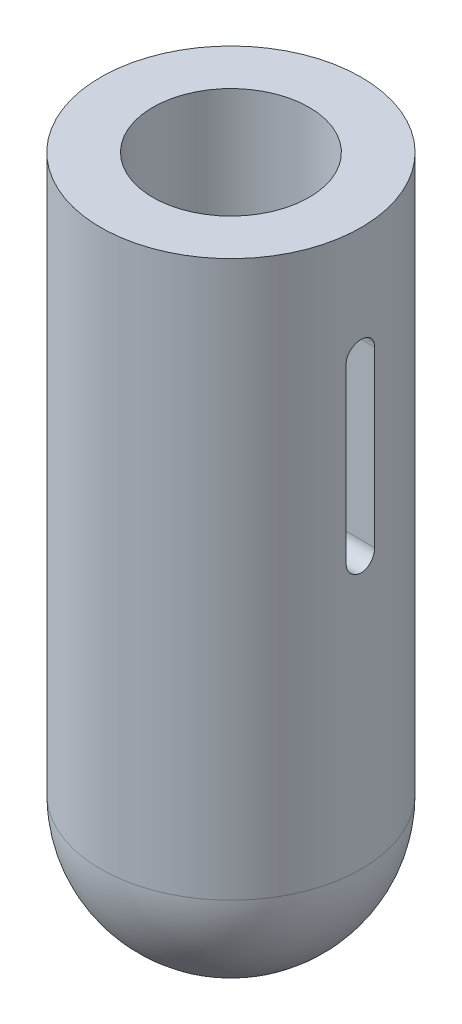
ISO-10303-21;
HEADER;
FILE_DESCRIPTION(('STEP AP214'),'2;1');
FILE_NAME('part.step','',(''),(''),'','','');
FILE_SCHEMA(('AUTOMOTIVE_DESIGN { 1 0 10303 214 1 1 1 1 }'));
ENDSEC;
DATA;
#1=APPLICATION_CONTEXT('core data for automotive mechanical design processes');
#2=APPLICATION_PROTOCOL_DEFINITION('international standard','automotive_design',2000,#1);
#3=PRODUCT_CONTEXT('',#1,'mechanical');
#4=PRODUCT('Part','Part','',(#3));
#5=PRODUCT_RELATED_PRODUCT_CATEGORY('part','',(#4));
#6=PRODUCT_DEFINITION_FORMATION('','',#4);
#7=PRODUCT_DEFINITION_CONTEXT('part definition',#1,'design');
#8=PRODUCT_DEFINITION('design','',#6,#7);
#9=PRODUCT_DEFINITION_SHAPE('','',#8);
#10=(LENGTH_UNIT() NAMED_UNIT(*) SI_UNIT(.MILLI.,.METRE.));
#11=(NAMED_UNIT(*) PLANE_ANGLE_UNIT() SI_UNIT($,.RADIAN.));
#12=(NAMED_UNIT(*) SI_UNIT($,.STERADIAN.) SOLID_ANGLE_UNIT());
#13=UNCERTAINTY_MEASURE_WITH_UNIT(LENGTH_MEASURE(1.E-05),#10,'distance_accuracy_value','');
#14=(GEOMETRIC_REPRESENTATION_CONTEXT(3) GLOBAL_UNCERTAINTY_ASSIGNED_CONTEXT((#13)) GLOBAL_UNIT_ASSIGNED_CONTEXT((#10,
#11,#12)) REPRESENTATION_CONTEXT('',''));
#15=CARTESIAN_POINT('',(0.,0.,0.));
#16=DIRECTION('',(0.,0.,1.));
#17=DIRECTION('',(1.,0.,0.));
#18=AXIS2_PLACEMENT_3D('',#15,#16,#17);
#19=CARTESIAN_POINT('',(0.,-80.,0.));
#20=DIRECTION('',(0.,-1.,0.));
#21=DIRECTION('',(0.,0.,-1.));
#22=AXIS2_PLACEMENT_3D('',#19,#20,#21);
#23=SPHERICAL_SURFACE('',#22,18.75);
#24=CARTESIAN_POINT('',(0.,-80.0000000000001,0.));
#25=DIRECTION('',(0.,-1.,0.));
#26=DIRECTION('',(0.,0.,-1.));
#27=AXIS2_PLACEMENT_3D('',#24,#25,#26);
#28=CIRCLE('',#27,18.75);
#29=CARTESIAN_POINT('',(0.,-80.0000000000001,-18.75));
#30=VERTEX_POINT('',#29);
#31=EDGE_CURVE('E127',#30,#30,#28,.T.);
#32=ORIENTED_EDGE('',*,*,#31,.T.);
#33=EDGE_LOOP('',(#32));
#34=FACE_BOUND('',#33,.T.);
#35=ADVANCED_FACE('F49',(#34),#23,.T.);
#36=CARTESIAN_POINT('',(0.,-1981.5227531434,0.));
#37=DIRECTION('',(0.,-1.,0.));
#38=DIRECTION('',(0.,0.,-1.));
#39=AXIS2_PLACEMENT_3D('',#36,#37,#38);
#40=CYLINDRICAL_SURFACE('',#39,18.75);
#41=DIRECTION('',(0.,-1.,0.));
#42=VECTOR('',#41,1.);
#43=CARTESIAN_POINT('',(-18.6375964115548,-1981.5227531434,2.04999999999996));
#44=LINE('',#43,#42);
#45=CARTESIAN_POINT('',(-18.6375964115548,-16.,2.04999999999976));
#46=VERTEX_POINT('',#45);
#47=CARTESIAN_POINT('',(-18.6375964115548,-41.,2.04999999999976));
#48=VERTEX_POINT('',#47);
#49=EDGE_CURVE('E262',#46,#48,#44,.T.);
#50=ORIENTED_EDGE('',*,*,#49,.T.);
#51=CARTESIAN_POINT('',(-18.6375964115548,-41.,2.04999999999976));
#52=CARTESIAN_POINT('',(-18.6375948880055,-41.0574914291114,2.04999982242696));
#53=CARTESIAN_POINT('',(-18.6378627665065,-41.1149551463357,2.04757999195597));
#54=CARTESIAN_POINT('',(-18.6389212594444,-41.2294680097201,2.03792764958876));
#55=CARTESIAN_POINT('',(-18.6397118372317,-41.2865171846628,2.03069547511465));
#56=CARTESIAN_POINT('',(-18.6428397371349,-41.4563078442637,2.0018552751752));
#57=CARTESIAN_POINT('',(-18.6459333417178,-41.5679066219225,1.9731033454633));
#58=CARTESIAN_POINT('',(-18.6537907574791,-41.7846531381598,1.89737235021396));
#59=CARTESIAN_POINT('',(-18.6585551689242,-41.8897985422775,1.85038673325802));
#60=CARTESIAN_POINT('',(-18.669215207986,-42.0907168730999,1.73953787474136));
#61=CARTESIAN_POINT('',(-18.6751107159932,-42.1864907891909,1.67567641747223));
#62=CARTESIAN_POINT('',(-18.6873964963591,-42.3663400795551,1.53260267904108));
#63=CARTESIAN_POINT('',(-18.6937885418897,-42.450370217876,1.45333370686668));
#64=CARTESIAN_POINT('',(-18.7063319078664,-42.6039725363797,1.28180620538432));
#65=CARTESIAN_POINT('',(-18.7124831915328,-42.67354251452,1.18954570126473));
#66=CARTESIAN_POINT('',(-18.7238692758046,-42.7963978528545,0.994375983931838));
#67=CARTESIAN_POINT('',(-18.7291017534306,-42.8496421838785,0.891440797357913));
#68=CARTESIAN_POINT('',(-18.7380406734316,-42.9380697413876,0.678029932361678));
#69=CARTESIAN_POINT('',(-18.74174725103,-42.9732545683514,0.567554923120916));
#70=CARTESIAN_POINT('',(-18.7472044905566,-43.0244325932931,0.342663496372218));
#71=CARTESIAN_POINT('',(-18.7489629154351,-43.0405019810151,0.228264608572564));
#72=CARTESIAN_POINT('',(-18.750352184942,-43.053228957539,-0.00162171163333828));
#73=CARTESIAN_POINT('',(-18.7499830428611,-43.0498866676027,-0.117109137235153));
#74=CARTESIAN_POINT('',(-18.7471650203424,-43.0239460380377,-0.345370400138518));
#75=CARTESIAN_POINT('',(-18.7447250485466,-43.0014301810784,-0.458153736549689));
#76=CARTESIAN_POINT('',(-18.7380497080879,-42.9379103037122,-0.678330554983966));
#77=CARTESIAN_POINT('',(-18.7338143215078,-42.8969060988015,-0.785723983206801));
#78=CARTESIAN_POINT('',(-18.7240087843966,-42.7974831328344,-0.992333458390541));
#79=CARTESIAN_POINT('',(-18.718435836331,-42.7390278091087,-1.09153177269504));
#80=CARTESIAN_POINT('',(-18.7065802234411,-42.6063910085039,-1.27873676372902));
#81=CARTESIAN_POINT('',(-18.7002975647813,-42.5322096682155,-1.36674353765358));
#82=CARTESIAN_POINT('',(-18.6876886909899,-42.3697752190201,-1.52954444248029));
#83=CARTESIAN_POINT('',(-18.6813624171744,-42.2814522463189,-1.60426887098877));
#84=CARTESIAN_POINT('',(-18.6694092197719,-42.0934460386603,-1.73786489875367));
#85=CARTESIAN_POINT('',(-18.6637825074247,-41.9937593896601,-1.79673171587437));
#86=CARTESIAN_POINT('',(-18.6538645391789,-41.7857858054332,-1.89694110738678));
#87=CARTESIAN_POINT('',(-18.6495744461202,-41.6774914838706,-1.93826843392709));
#88=CARTESIAN_POINT('',(-18.6428339207719,-41.4555230620672,-2.00207141708797));
#89=CARTESIAN_POINT('',(-18.6403807107687,-41.341857362233,-2.02457554399509));
#90=CARTESIAN_POINT('',(-18.6385209001405,-41.1894901888515,-2.04157917812848));
#91=CARTESIAN_POINT('',(-18.6381744456185,-41.1516282935936,-2.04473853023732));
#92=CARTESIAN_POINT('',(-18.6377124809882,-41.075849556767,-2.0489460993144));
#93=CARTESIAN_POINT('',(-18.6375965848836,-41.0379329135675,-2.0499978448174));
#94=CARTESIAN_POINT('',(-18.6375964115548,-41.,-2.05000000000024));
#95=B_SPLINE_CURVE_WITH_KNOTS('',3,(#51,#52,#53,#54,#55,#56,#57,#58,#59,#60,#61,#62,#63,#64,#65,
#66,#67,#68,#69,#70,#71,#72,#73,#74,#75,#76,#77,#78,#79,#80,#81,#82,#83,#84,#85,#86,#87,#88,#89,
#90,#91,#92,#93,#94),.UNSPECIFIED.,.F.,.F.,(4,2,2,2,2,2,2,2,2,2,2,2,2,2,2,2,2,2,2,2,2,4),(0.,
0.172367808762385,0.344723533063818,0.688800722758524,1.03300165505428,1.37716620935314,
1.72262192398135,2.06813020730473,2.41449982692157,2.76083874508752,3.10579256059419,
3.45074422122822,3.79421938945708,4.13769798545925,4.48190133147376,4.82610168798399,
5.17205817025348,5.51811886515723,5.86447979265253,6.21031589341327,6.32425828595697,
6.43800975733192),.UNSPECIFIED.);
#96=CARTESIAN_POINT('',(-18.6375964115548,-41.,-2.05000000000024));
#97=VERTEX_POINT('',#96);
#98=EDGE_CURVE('E64',#48,#97,#95,.T.);
#99=ORIENTED_EDGE('',*,*,#98,.T.);
#100=DIRECTION('',(0.,-1.,0.));
#101=VECTOR('',#100,1.);
#102=CARTESIAN_POINT('',(-18.6375964115548,-1981.5227531434,-2.04999999999997));
#103=LINE('',#102,#101);
#104=CARTESIAN_POINT('',(-18.6375964115548,-16.,-2.05000000000024));
#105=VERTEX_POINT('',#104);
#106=EDGE_CURVE('E133',#105,#97,#103,.T.);
#107=ORIENTED_EDGE('',*,*,#106,.F.);
#108=CARTESIAN_POINT('',(-18.6375964115548,-16.,-2.05));
#109=CARTESIAN_POINT('',(-18.6375948880055,-15.9425085708886,-2.0499998224272));
#110=CARTESIAN_POINT('',(-18.6378627665065,-15.8850448536643,-2.04757999195621));
#111=CARTESIAN_POINT('',(-18.6389212594444,-15.7705319902799,-2.037927649589));
#112=CARTESIAN_POINT('',(-18.6397118372317,-15.7134828153372,-2.03069547511489));
#113=CARTESIAN_POINT('',(-18.6428397371349,-15.5436921557363,-2.00185527517544));
#114=CARTESIAN_POINT('',(-18.6459333417177,-15.4320933780775,-1.97310334546354));
#115=CARTESIAN_POINT('',(-18.6537907574791,-15.2153468618402,-1.89737235021421));
#116=CARTESIAN_POINT('',(-18.6585551689242,-15.1102014577225,-1.85038673325826));
#117=CARTESIAN_POINT('',(-18.669215207986,-14.9092831269002,-1.7395378747416));
#118=CARTESIAN_POINT('',(-18.6751107159932,-14.8135092108091,-1.67567641747247));
#119=CARTESIAN_POINT('',(-18.6873964963591,-14.6336599204449,-1.53260267904132));
#120=CARTESIAN_POINT('',(-18.6937885418897,-14.549629782124,-1.45333370686693));
#121=CARTESIAN_POINT('',(-18.7063319078664,-14.3960274636203,-1.28180620538456));
#122=CARTESIAN_POINT('',(-18.7124831915328,-14.32645748548,-1.18954570126498));
#123=CARTESIAN_POINT('',(-18.7238692758046,-14.2036021471455,-0.994375983932079));
#124=CARTESIAN_POINT('',(-18.7291017534306,-14.1503578161215,-0.891440797358156));
#125=CARTESIAN_POINT('',(-18.7380406734316,-14.0619302586124,-0.678029932361921));
#126=CARTESIAN_POINT('',(-18.7417472510299,-14.0267454316486,-0.56755492312116));
#127=CARTESIAN_POINT('',(-18.7472044905566,-13.9755674067069,-0.342663496372463));
#128=CARTESIAN_POINT('',(-18.7489629154351,-13.9594980189849,-0.228264608572808));
#129=CARTESIAN_POINT('',(-18.750352184942,-13.946771042461,0.00162171163309494));
#130=CARTESIAN_POINT('',(-18.7499830428611,-13.9501133323973,0.11710913723491));
#131=CARTESIAN_POINT('',(-18.7471650203424,-13.9760539619623,0.345370400138276));
#132=CARTESIAN_POINT('',(-18.7447250485466,-13.9985698189216,0.458153736549447));
#133=CARTESIAN_POINT('',(-18.7380497080879,-14.0620896962878,0.678330554983725));
#134=CARTESIAN_POINT('',(-18.7338143215078,-14.1030939011985,0.78572398320656));
#135=CARTESIAN_POINT('',(-18.7240087843966,-14.2025168671656,0.992333458390302));
#136=CARTESIAN_POINT('',(-18.718435836331,-14.2609721908913,1.0915317726948));
#137=CARTESIAN_POINT('',(-18.7065802234411,-14.3936089914961,1.27873676372878));
#138=CARTESIAN_POINT('',(-18.7002975647813,-14.4677903317845,1.36674353765334));
#139=CARTESIAN_POINT('',(-18.68768869099,-14.6302247809799,1.52954444248005));
#140=CARTESIAN_POINT('',(-18.6813624171744,-14.7185477536811,1.60426887098854));
#141=CARTESIAN_POINT('',(-18.6694092197719,-14.9065539613397,1.73786489875343));
#142=CARTESIAN_POINT('',(-18.6637825074247,-15.0062406103398,1.79673171587413));
#143=CARTESIAN_POINT('',(-18.6538645391789,-15.2142141945668,1.89694110738654));
#144=CARTESIAN_POINT('',(-18.6495744461202,-15.3225085161294,1.93826843392685));
#145=CARTESIAN_POINT('',(-18.6428339207719,-15.5444769379328,2.00207141708773));
#146=CARTESIAN_POINT('',(-18.6403807107688,-15.658142637767,2.02457554399485));
#147=CARTESIAN_POINT('',(-18.6385209001405,-15.8105098111485,2.04157917812824));
#148=CARTESIAN_POINT('',(-18.6381744456185,-15.8483717064064,2.04473853023708));
#149=CARTESIAN_POINT('',(-18.6377124809883,-15.924150443233,2.04894609931416));
#150=CARTESIAN_POINT('',(-18.6375965848837,-15.9620670864325,2.04999784481716));
#151=CARTESIAN_POINT('',(-18.6375964115548,-16.,2.05));
#152=B_SPLINE_CURVE_WITH_KNOTS('',3,(#108,#109,#110,#111,#112,#113,#114,#115,#116,#117,#118,
#119,#120,#121,#122,#123,#124,#125,#126,#127,#128,#129,#130,#131,#132,#133,#134,#135,#136,#137,
#138,#139,#140,#141,#142,#143,#144,#145,#146,#147,#148,#149,#150,#151),.UNSPECIFIED.,.F.,.F.,(4,
2,2,2,2,2,2,2,2,2,2,2,2,2,2,2,2,2,2,2,2,4),(0.,0.172367808762385,0.344723533063812,
0.688800722758522,1.03300165505427,1.37716620935314,1.72262192398134,2.06813020730473,
2.41449982692157,2.76083874508751,3.10579256059419,3.45074422122822,3.79421938945707,
4.13769798545924,4.48190133147376,4.82610168798399,5.17205817025348,5.51811886515722,
5.86447979265252,6.21031589341327,6.32425828595697,6.43800975733193),.UNSPECIFIED.);
#153=EDGE_CURVE('E182',#105,#46,#152,.T.);
#154=ORIENTED_EDGE('',*,*,#153,.T.);
#155=EDGE_LOOP('',(#50,#99,#107,#154));
#156=FACE_BOUND('',#155,.T.);
#157=DIRECTION('',(0.,-1.,0.));
#158=VECTOR('',#157,1.);
#159=CARTESIAN_POINT('',(18.6375964115548,-1981.5227531434,-2.04999999999997));
#160=LINE('',#159,#158);
#161=CARTESIAN_POINT('',(18.6375964115548,-41.,-2.05000000000024));
#162=VERTEX_POINT('',#161);
#163=CARTESIAN_POINT('',(18.6375964115548,-16.,-2.05000000000024));
#164=VERTEX_POINT('',#163);
#165=EDGE_CURVE('E215',#162,#164,#160,.F.);
#166=ORIENTED_EDGE('',*,*,#165,.F.);
#167=CARTESIAN_POINT('',(18.6375964115548,-41.,-2.05000000000024));
#168=CARTESIAN_POINT('',(18.6375948880054,-41.0574914291114,-2.04999982242744));
#169=CARTESIAN_POINT('',(18.6378627665065,-41.1149551463357,-2.04757999195645));
#170=CARTESIAN_POINT('',(18.6389212594444,-41.2294680097201,-2.03792764958924));
#171=CARTESIAN_POINT('',(18.6397118372316,-41.2865171846628,-2.03069547511513));
#172=CARTESIAN_POINT('',(18.6428397371349,-41.4563078442637,-2.00185527517567));
#173=CARTESIAN_POINT('',(18.6459333417177,-41.5679066219225,-1.97310334546378));
#174=CARTESIAN_POINT('',(18.6537907574791,-41.7846531381598,-1.89737235021444));
#175=CARTESIAN_POINT('',(18.6585551689242,-41.8897985422775,-1.85038673325849));
#176=CARTESIAN_POINT('',(18.669215207986,-42.0907168730999,-1.73953787474184));
#177=CARTESIAN_POINT('',(18.6751107159932,-42.1864907891909,-1.67567641747271));
#178=CARTESIAN_POINT('',(18.6873964963591,-42.3663400795551,-1.53260267904155));
#179=CARTESIAN_POINT('',(18.6937885418897,-42.450370217876,-1.45333370686716));
#180=CARTESIAN_POINT('',(18.7063319078664,-42.6039725363797,-1.2818062053848));
#181=CARTESIAN_POINT('',(18.7124831915328,-42.67354251452,-1.18954570126522));
#182=CARTESIAN_POINT('',(18.7238692758046,-42.7963978528545,-0.994375983932319));
#183=CARTESIAN_POINT('',(18.7291017534306,-42.8496421838785,-0.891440797358393));
#184=CARTESIAN_POINT('',(18.7380406734316,-42.9380697413876,-0.678029932362157));
#185=CARTESIAN_POINT('',(18.7417472510299,-42.9732545683514,-0.567554923121396));
#186=CARTESIAN_POINT('',(18.7472044905566,-43.0244325932931,-0.342663496372698));
#187=CARTESIAN_POINT('',(18.7489629154351,-43.0405019810151,-0.228264608573043));
#188=CARTESIAN_POINT('',(18.750352184942,-43.053228957539,0.00162171163285936));
#189=CARTESIAN_POINT('',(18.7499830428611,-43.0498866676027,0.117109137234675));
#190=CARTESIAN_POINT('',(18.7471650203424,-43.0239460380377,0.34537040013804));
#191=CARTESIAN_POINT('',(18.7447250485466,-43.0014301810784,0.45815373654921));
#192=CARTESIAN_POINT('',(18.738049708088,-42.9379103037122,0.678330554983488));
#193=CARTESIAN_POINT('',(18.7338143215078,-42.8969060988015,0.785723983206324));
#194=CARTESIAN_POINT('',(18.7240087843967,-42.7974831328344,0.992333458390066));
#195=CARTESIAN_POINT('',(18.7184358363311,-42.7390278091087,1.09153177269457));
#196=CARTESIAN_POINT('',(18.7065802234411,-42.6063910085039,1.27873676372854));
#197=CARTESIAN_POINT('',(18.7002975647813,-42.5322096682155,1.36674353765311));
#198=CARTESIAN_POINT('',(18.68768869099,-42.3697752190201,1.52954444247982));
#199=CARTESIAN_POINT('',(18.6813624171744,-42.2814522463189,1.6042688709883));
#200=CARTESIAN_POINT('',(18.669409219772,-42.0934460386603,1.73786489875319));
#201=CARTESIAN_POINT('',(18.6637825074247,-41.9937593896602,1.79673171587389));
#202=CARTESIAN_POINT('',(18.6538645391789,-41.7857858054332,1.8969411073863));
#203=CARTESIAN_POINT('',(18.6495744461202,-41.6774914838706,1.93826843392661));
#204=CARTESIAN_POINT('',(18.6428339207719,-41.4555230620672,2.00207141708749));
#205=CARTESIAN_POINT('',(18.6403807107688,-41.341857362233,2.02457554399461));
#206=CARTESIAN_POINT('',(18.6385209001406,-41.1894901888515,2.04157917812801));
#207=CARTESIAN_POINT('',(18.6381744456186,-41.1516282935936,2.04473853023684));
#208=CARTESIAN_POINT('',(18.6377124809883,-41.075849556767,2.04894609931392));
#209=CARTESIAN_POINT('',(18.6375965848837,-41.0379329135675,2.04999784481692));
#210=CARTESIAN_POINT('',(18.6375964115548,-41.,2.04999999999976));
#211=B_SPLINE_CURVE_WITH_KNOTS('',3,(#167,#168,#169,#170,#171,#172,#173,#174,#175,#176,#177,
#178,#179,#180,#181,#182,#183,#184,#185,#186,#187,#188,#189,#190,#191,#192,#193,#194,#195,#196,
#197,#198,#199,#200,#201,#202,#203,#204,#205,#206,#207,#208,#209,#210),.UNSPECIFIED.,.F.,.F.,(4,
2,2,2,2,2,2,2,2,2,2,2,2,2,2,2,2,2,2,2,2,4),(0.,0.172367808762385,0.344723533063812,
0.688800722758524,1.03300165505428,1.37716620935314,1.72262192398134,2.06813020730473,
2.41449982692157,2.76083874508752,3.10579256059419,3.45074422122823,3.79421938945708,
4.13769798545925,4.48190133147377,4.82610168798399,5.17205817025348,5.51811886515723,
5.86447979265252,6.21031589341327,6.32425828595697,6.43800975733192),.UNSPECIFIED.);
#212=CARTESIAN_POINT('',(18.6375964115548,-41.,2.04999999999976));
#213=VERTEX_POINT('',#212);
#214=EDGE_CURVE('E72',#162,#213,#211,.T.);
#215=ORIENTED_EDGE('',*,*,#214,.T.);
#216=DIRECTION('',(0.,-1.,0.));
#217=VECTOR('',#216,1.);
#218=CARTESIAN_POINT('',(18.6375964115548,-1981.5227531434,2.04999999999996));
#219=LINE('',#218,#217);
#220=CARTESIAN_POINT('',(18.6375964115548,-16.,2.04999999999976));
#221=VERTEX_POINT('',#220);
#222=EDGE_CURVE('E260',#213,#221,#219,.F.);
#223=ORIENTED_EDGE('',*,*,#222,.T.);
#224=CARTESIAN_POINT('',(18.6375964115548,-16.,2.05));
#225=CARTESIAN_POINT('',(18.6375948880055,-15.9425085708886,2.0499998224272));
#226=CARTESIAN_POINT('',(18.6378627665065,-15.8850448536643,2.04757999195621));
#227=CARTESIAN_POINT('',(18.6389212594444,-15.7705319902799,2.037927649589));
#228=CARTESIAN_POINT('',(18.6397118372317,-15.7134828153372,2.03069547511489));
#229=CARTESIAN_POINT('',(18.6428397371349,-15.5436921557363,2.00185527517544));
#230=CARTESIAN_POINT('',(18.6459333417177,-15.4320933780775,1.97310334546354));
#231=CARTESIAN_POINT('',(18.6537907574791,-15.2153468618402,1.89737235021421));
#232=CARTESIAN_POINT('',(18.6585551689242,-15.1102014577225,1.85038673325826));
#233=CARTESIAN_POINT('',(18.669215207986,-14.9092831269002,1.7395378747416));
#234=CARTESIAN_POINT('',(18.6751107159932,-14.8135092108091,1.67567641747247));
#235=CARTESIAN_POINT('',(18.6873964963591,-14.6336599204449,1.53260267904132));
#236=CARTESIAN_POINT('',(18.6937885418897,-14.549629782124,1.45333370686693));
#237=CARTESIAN_POINT('',(18.7063319078664,-14.3960274636203,1.28180620538456));
#238=CARTESIAN_POINT('',(18.7124831915328,-14.32645748548,1.18954570126498));
#239=CARTESIAN_POINT('',(18.7238692758046,-14.2036021471455,0.994375983932079));
#240=CARTESIAN_POINT('',(18.7291017534306,-14.1503578161215,0.891440797358156));
#241=CARTESIAN_POINT('',(18.7380406734316,-14.0619302586124,0.678029932361921));
#242=CARTESIAN_POINT('',(18.7417472510299,-14.0267454316486,0.56755492312116));
#243=CARTESIAN_POINT('',(18.7472044905566,-13.9755674067069,0.342663496372463));
#244=CARTESIAN_POINT('',(18.7489629154351,-13.9594980189849,0.228264608572808));
#245=CARTESIAN_POINT('',(18.750352184942,-13.946771042461,-0.00162171163309494));
#246=CARTESIAN_POINT('',(18.7499830428611,-13.9501133323973,-0.11710913723491));
#247=CARTESIAN_POINT('',(18.7471650203424,-13.9760539619623,-0.345370400138276));
#248=CARTESIAN_POINT('',(18.7447250485466,-13.9985698189216,-0.458153736549447));
#249=CARTESIAN_POINT('',(18.7380497080879,-14.0620896962878,-0.678330554983725));
#250=CARTESIAN_POINT('',(18.7338143215078,-14.1030939011985,-0.78572398320656));
#251=CARTESIAN_POINT('',(18.7240087843966,-14.2025168671656,-0.992333458390302));
#252=CARTESIAN_POINT('',(18.718435836331,-14.2609721908913,-1.0915317726948));
#253=CARTESIAN_POINT('',(18.7065802234411,-14.3936089914961,-1.27873676372878));
#254=CARTESIAN_POINT('',(18.7002975647813,-14.4677903317845,-1.36674353765334));
#255=CARTESIAN_POINT('',(18.68768869099,-14.6302247809799,-1.52954444248005));
#256=CARTESIAN_POINT('',(18.6813624171744,-14.7185477536811,-1.60426887098854));
#257=CARTESIAN_POINT('',(18.6694092197719,-14.9065539613397,-1.73786489875343));
#258=CARTESIAN_POINT('',(18.6637825074247,-15.0062406103398,-1.79673171587413));
#259=CARTESIAN_POINT('',(18.6538645391789,-15.2142141945668,-1.89694110738654));
#260=CARTESIAN_POINT('',(18.6495744461202,-15.3225085161294,-1.93826843392685));
#261=CARTESIAN_POINT('',(18.6428339207719,-15.5444769379328,-2.00207141708773));
#262=CARTESIAN_POINT('',(18.6403807107688,-15.658142637767,-2.02457554399485));
#263=CARTESIAN_POINT('',(18.6385209001405,-15.8105098111485,-2.04157917812824));
#264=CARTESIAN_POINT('',(18.6381744456185,-15.8483717064064,-2.04473853023708));
#265=CARTESIAN_POINT('',(18.6377124809883,-15.924150443233,-2.04894609931416));
#266=CARTESIAN_POINT('',(18.6375965848837,-15.9620670864325,-2.04999784481716));
#267=CARTESIAN_POINT('',(18.6375964115548,-16.,-2.05));
#268=B_SPLINE_CURVE_WITH_KNOTS('',3,(#224,#225,#226,#227,#228,#229,#230,#231,#232,#233,#234,
#235,#236,#237,#238,#239,#240,#241,#242,#243,#244,#245,#246,#247,#248,#249,#250,#251,#252,#253,
#254,#255,#256,#257,#258,#259,#260,#261,#262,#263,#264,#265,#266,#267),.UNSPECIFIED.,.F.,.F.,(4,
2,2,2,2,2,2,2,2,2,2,2,2,2,2,2,2,2,2,2,2,4),(0.,0.172367808762385,0.344723533063812,
0.688800722758522,1.03300165505427,1.37716620935314,1.72262192398134,2.06813020730473,
2.41449982692157,2.76083874508751,3.10579256059419,3.45074422122822,3.79421938945707,
4.13769798545924,4.48190133147376,4.82610168798399,5.17205817025348,5.51811886515722,
5.86447979265252,6.21031589341327,6.32425828595697,6.43800975733193),.UNSPECIFIED.);
#269=EDGE_CURVE('E189',#221,#164,#268,.T.);
#270=ORIENTED_EDGE('',*,*,#269,.T.);
#271=EDGE_LOOP('',(#166,#215,#223,#270));
#272=FACE_BOUND('',#271,.T.);
#273=ORIENTED_EDGE('',*,*,#31,.F.);
#274=EDGE_LOOP('',(#273));
#275=FACE_BOUND('',#274,.T.);
#276=CARTESIAN_POINT('',(0.,0.,0.));
#277=DIRECTION('',(0.,-1.,0.));
#278=DIRECTION('',(0.,0.,-1.));
#279=AXIS2_PLACEMENT_3D('',#276,#277,#278);
#280=CIRCLE('',#279,18.75);
#281=CARTESIAN_POINT('',(0.,0.,-18.75));
#282=VERTEX_POINT('',#281);
#283=EDGE_CURVE('E275',#282,#282,#280,.T.);
#284=ORIENTED_EDGE('',*,*,#283,.T.);
#285=EDGE_LOOP('',(#284));
#286=FACE_BOUND('',#285,.T.);
#287=ADVANCED_FACE('F196',(#156,#272,#275,#286),#40,.T.);
#288=CARTESIAN_POINT('',(0.,0.,0.));
#289=DIRECTION('',(0.,-1.,0.));
#290=DIRECTION('',(0.,0.,-1.));
#291=AXIS2_PLACEMENT_3D('',#288,#289,#290);
#292=PLANE('',#291);
#293=ORIENTED_EDGE('',*,*,#283,.F.);
#294=EDGE_LOOP('',(#293));
#295=FACE_BOUND('',#294,.T.);
#296=CARTESIAN_POINT('',(0.,0.,0.));
#297=DIRECTION('',(0.,-1.,0.));
#298=DIRECTION('',(0.,0.,-1.));
#299=AXIS2_PLACEMENT_3D('',#296,#297,#298);
#300=CIRCLE('',#299,11.25);
#301=CARTESIAN_POINT('',(0.,0.,-11.25));
#302=VERTEX_POINT('',#301);
#303=EDGE_CURVE('E271',#302,#302,#300,.T.);
#304=ORIENTED_EDGE('',*,*,#303,.T.);
#305=EDGE_LOOP('',(#304));
#306=FACE_BOUND('',#305,.T.);
#307=ADVANCED_FACE('F199',(#295,#306),#292,.F.);
#308=CARTESIAN_POINT('',(0.,-1981.5227531434,0.));
#309=DIRECTION('',(0.,-1.,0.));
#310=DIRECTION('',(0.,0.,-1.));
#311=AXIS2_PLACEMENT_3D('',#308,#309,#310);
#312=CYLINDRICAL_SURFACE('',#311,11.25);
#313=DIRECTION('',(0.,-1.,0.));
#314=VECTOR('',#313,1.);
#315=CARTESIAN_POINT('',(11.0616454472199,-1981.5227531434,2.04999999999996));
#316=LINE('',#315,#314);
#317=CARTESIAN_POINT('',(11.0616454472199,-41.,2.04999999999976));
#318=VERTEX_POINT('',#317);
#319=CARTESIAN_POINT('',(11.0616454472199,-16.,2.04999999999976));
#320=VERTEX_POINT('',#319);
#321=EDGE_CURVE('E11',#318,#320,#316,.F.);
#322=ORIENTED_EDGE('',*,*,#321,.F.);
#323=CARTESIAN_POINT('',(11.0616454472198,-41.,-2.05000000000024));
#324=CARTESIAN_POINT('',(11.0616428090112,-41.0571639629922,-2.050000187661));
#325=CARTESIAN_POINT('',(11.0620891262686,-41.1143000612189,-2.04760747321184));
#326=CARTESIAN_POINT('',(11.0638520899171,-41.2281538689705,-2.03806570327886));
#327=CARTESIAN_POINT('',(11.0651686401121,-41.2848716240388,-2.03091717350537));
#328=CARTESIAN_POINT('',(11.0703745371001,-41.4536166955099,-2.00242444222445));
#329=CARTESIAN_POINT('',(11.0755203769883,-41.5644985994413,-1.97403278576152));
#330=CARTESIAN_POINT('',(11.0885765083076,-41.7798193519848,-1.89931321644023));
#331=CARTESIAN_POINT('',(11.0964872732127,-41.884257093473,-1.85298223145058));
#332=CARTESIAN_POINT('',(11.114177976708,-42.0839021593815,-1.74373142893518));
#333=CARTESIAN_POINT('',(11.1239580150467,-42.1791089908104,-1.68081072607598));
#334=CARTESIAN_POINT('',(11.1444120644654,-42.3586670462403,-1.53939023669964));
#335=CARTESIAN_POINT('',(11.1550943284473,-42.442894825275,-1.46073495636629));
#336=CARTESIAN_POINT('',(11.1760773638173,-42.5970441796578,-1.29040496128178));
#337=CARTESIAN_POINT('',(11.1863780762797,-42.6669635527394,-1.19872824602035));
#338=CARTESIAN_POINT('',(11.2055252544955,-42.7909744391825,-1.00414839542935));
#339=CARTESIAN_POINT('',(11.2143607739662,-42.844948979628,-0.901169542872808));
#340=CARTESIAN_POINT('',(11.2294885192683,-42.9347826365097,-0.687423832036107));
#341=CARTESIAN_POINT('',(11.2357810842783,-42.9706441690127,-0.576658014693983));
#342=CARTESIAN_POINT('',(11.2450558194795,-43.0228540287131,-0.351767409521638));
#343=CARTESIAN_POINT('',(11.2480735633994,-43.0394121943209,-0.237692828367123));
#344=CARTESIAN_POINT('',(11.2505811851668,-43.0531988908862,-0.00834478149119888));
#345=CARTESIAN_POINT('',(11.2500712645662,-43.0504285261732,0.106928615360505));
#346=CARTESIAN_POINT('',(11.2456087726303,-43.0257977286875,0.333958351248489));
#347=CARTESIAN_POINT('',(11.2416970335014,-43.0041637092346,0.445740172519347));
#348=CARTESIAN_POINT('',(11.2309161924313,-42.9427775369313,0.66405926855061));
#349=CARTESIAN_POINT('',(11.2240470072824,-42.9030248743114,0.77059639565765));
#350=CARTESIAN_POINT('',(11.2080543776237,-42.8063109824793,0.976065530956684));
#351=CARTESIAN_POINT('',(11.1989189909229,-42.7492582209729,1.07495348737037));
#352=CARTESIAN_POINT('',(11.1794059462247,-42.6196328405547,1.26183341258601));
#353=CARTESIAN_POINT('',(11.1690282120948,-42.5470592702963,1.34982471295607));
#354=CARTESIAN_POINT('',(11.1480046509599,-42.3872135029,1.51374752410995));
#355=CARTESIAN_POINT('',(11.1373571144581,-42.2997450609963,1.58948755223655));
#356=CARTESIAN_POINT('',(11.1171340054701,-42.1132147389834,1.72527111205714));
#357=CARTESIAN_POINT('',(11.1075587346348,-42.0141496124328,1.78531023306499));
#358=CARTESIAN_POINT('',(11.090560708347,-41.8069782906209,1.88803881839546));
#359=CARTESIAN_POINT('',(11.083142507246,-41.6988535780826,1.93069164915206));
#360=CARTESIAN_POINT('',(11.0713682930319,-41.4768797959702,1.99711322626236));
#361=CARTESIAN_POINT('',(11.0670077122538,-41.3630395384528,2.02091014770128));
#362=CARTESIAN_POINT('',(11.0635031087255,-41.206927859908,2.03995410742033));
#363=CARTESIAN_POINT('',(11.0628071700444,-41.1655987412884,2.04372277568616));
#364=CARTESIAN_POINT('',(11.061878772099,-41.0828525241961,2.04874249474841));
#365=CARTESIAN_POINT('',(11.0616455342385,-41.0414356911196,2.04999777490879));
#366=CARTESIAN_POINT('',(11.0616454472199,-41.,2.04999999999976));
#367=B_SPLINE_CURVE_WITH_KNOTS('',3,(#323,#324,#325,#326,#327,#328,#329,#330,#331,#332,#333,
#334,#335,#336,#337,#338,#339,#340,#341,#342,#343,#344,#345,#346,#347,#348,#349,#350,#351,#352,
#353,#354,#355,#356,#357,#358,#359,#360,#361,#362,#363,#364,#365,#366),.UNSPECIFIED.,.F.,.F.,(4,
2,2,2,2,2,2,2,2,2,2,2,2,2,2,2,2,2,2,2,2,4),(0.,0.171385020865105,0.342751099886743,
0.684705081925249,1.02671764990721,1.36874847356252,1.71434305386743,2.05999078613459,
2.40811460863105,2.75619198314676,3.1004491986982,3.44468674538361,3.78484854559661,
4.12501991688149,4.4670234539989,4.80904796020512,5.15598767624012,5.50302474985812,
5.85078931020308,6.19803324482154,6.32249263810188,6.4467424227069),.UNSPECIFIED.);
#368=CARTESIAN_POINT('',(11.0616454472198,-41.,-2.05000000000024));
#369=VERTEX_POINT('',#368);
#370=EDGE_CURVE('E225',#369,#318,#367,.T.);
#371=ORIENTED_EDGE('',*,*,#370,.F.);
#372=DIRECTION('',(0.,-1.,0.));
#373=VECTOR('',#372,1.);
#374=CARTESIAN_POINT('',(11.0616454472199,-1981.5227531434,-2.04999999999997));
#375=LINE('',#374,#373);
#376=CARTESIAN_POINT('',(11.0616454472199,-16.,-2.05000000000024));
#377=VERTEX_POINT('',#376);
#378=EDGE_CURVE('E231',#369,#377,#375,.F.);
#379=ORIENTED_EDGE('',*,*,#378,.T.);
#380=CARTESIAN_POINT('',(11.0616454472199,-16.,2.05));
#381=CARTESIAN_POINT('',(11.0616428090113,-15.9428360370078,2.05000018766076));
#382=CARTESIAN_POINT('',(11.0620891262687,-15.8856999387811,2.0476074732116));
#383=CARTESIAN_POINT('',(11.0638520899172,-15.7718461310295,2.03806570327862));
#384=CARTESIAN_POINT('',(11.0651686401122,-15.7151283759612,2.03091717350513));
#385=CARTESIAN_POINT('',(11.0703745371002,-15.5463833044901,2.00242444222422));
#386=CARTESIAN_POINT('',(11.0755203769883,-15.4355014005587,1.97403278576128));
#387=CARTESIAN_POINT('',(11.0885765083076,-15.2201806480152,1.89931321643999));
#388=CARTESIAN_POINT('',(11.0964872732128,-15.115742906527,1.85298223145035));
#389=CARTESIAN_POINT('',(11.114177976708,-14.9160978406185,1.74373142893494));
#390=CARTESIAN_POINT('',(11.1239580150468,-14.8208910091896,1.68081072607575));
#391=CARTESIAN_POINT('',(11.1444120644655,-14.6413329537597,1.5393902366994));
#392=CARTESIAN_POINT('',(11.1550943284473,-14.557105174725,1.46073495636606));
#393=CARTESIAN_POINT('',(11.1760773638173,-14.4029558203423,1.29040496128154));
#394=CARTESIAN_POINT('',(11.1863780762797,-14.3330364472606,1.19872824602011));
#395=CARTESIAN_POINT('',(11.2055252544956,-14.2090255608175,1.00414839542911));
#396=CARTESIAN_POINT('',(11.2143607739662,-14.155051020372,0.901169542872566));
#397=CARTESIAN_POINT('',(11.2294885192684,-14.0652173634903,0.687423832035865));
#398=CARTESIAN_POINT('',(11.2357810842784,-14.0293558309873,0.576658014693742));
#399=CARTESIAN_POINT('',(11.2450558194795,-13.9771459712869,0.351767409521396));
#400=CARTESIAN_POINT('',(11.2480735633994,-13.9605878056791,0.237692828366882));
#401=CARTESIAN_POINT('',(11.2505811851668,-13.9468011091138,0.00834478149095919));
#402=CARTESIAN_POINT('',(11.2500712645662,-13.9495714738268,-0.106928615360744));
#403=CARTESIAN_POINT('',(11.2456087726302,-13.9742022713125,-0.333958351248728));
#404=CARTESIAN_POINT('',(11.2416970335013,-13.9958362907654,-0.445740172519585));
#405=CARTESIAN_POINT('',(11.2309161924313,-14.0572224630687,-0.664059268550847));
#406=CARTESIAN_POINT('',(11.2240470072824,-14.0969751256886,-0.770596395657887));
#407=CARTESIAN_POINT('',(11.2080543776236,-14.1936890175207,-0.976065530956921));
#408=CARTESIAN_POINT('',(11.1989189909229,-14.2507417790271,-1.07495348737061));
#409=CARTESIAN_POINT('',(11.1794059462246,-14.3803671594453,-1.26183341258624));
#410=CARTESIAN_POINT('',(11.1690282120948,-14.4529407297037,-1.3498247129563));
#411=CARTESIAN_POINT('',(11.1480046509598,-14.6127864971,-1.51374752411019));
#412=CARTESIAN_POINT('',(11.1373571144581,-14.7002549390037,-1.58948755223679));
#413=CARTESIAN_POINT('',(11.11713400547,-14.8867852610166,-1.72527111205738));
#414=CARTESIAN_POINT('',(11.1075587346348,-14.9858503875672,-1.78531023306523));
#415=CARTESIAN_POINT('',(11.090560708347,-15.1930217093791,-1.8880388183957));
#416=CARTESIAN_POINT('',(11.083142507246,-15.3011464219174,-1.9306916491523));
#417=CARTESIAN_POINT('',(11.0713682930319,-15.5231202040298,-1.9971132262626));
#418=CARTESIAN_POINT('',(11.0670077122538,-15.6369604615472,-2.02091014770151));
#419=CARTESIAN_POINT('',(11.0635031087254,-15.7930721400919,-2.03995410742056));
#420=CARTESIAN_POINT('',(11.0628071700443,-15.8344012587115,-2.0437227756864));
#421=CARTESIAN_POINT('',(11.061878772099,-15.9171474758039,-2.04874249474864));
#422=CARTESIAN_POINT('',(11.0616455342384,-15.9585643088804,-2.04999777490903));
#423=CARTESIAN_POINT('',(11.0616454472199,-16.,-2.05));
#424=B_SPLINE_CURVE_WITH_KNOTS('',3,(#380,#381,#382,#383,#384,#385,#386,#387,#388,#389,#390,
#391,#392,#393,#394,#395,#396,#397,#398,#399,#400,#401,#402,#403,#404,#405,#406,#407,#408,#409,
#410,#411,#412,#413,#414,#415,#416,#417,#418,#419,#420,#421,#422,#423),.UNSPECIFIED.,.F.,.F.,(4,
2,2,2,2,2,2,2,2,2,2,2,2,2,2,2,2,2,2,2,2,4),(0.,0.171385020865108,0.342751099886747,
0.684705081925247,1.0267176499072,1.36874847356252,1.71434305386742,2.05999078613459,
2.40811460863106,2.75619198314676,3.1004491986982,3.44468674538361,3.78484854559661,
4.12501991688149,4.4670234539989,4.80904796020512,5.15598767624012,5.50302474985812,
5.85078931020308,6.19803324482154,6.32249263810188,6.4467424227069),.UNSPECIFIED.);
#425=EDGE_CURVE('E57',#320,#377,#424,.T.);
#426=ORIENTED_EDGE('',*,*,#425,.F.);
#427=EDGE_LOOP('',(#322,#371,#379,#426));
#428=FACE_BOUND('',#427,.T.);
#429=DIRECTION('',(0.,-1.,0.));
#430=VECTOR('',#429,1.);
#431=CARTESIAN_POINT('',(-11.0616454472199,-1981.5227531434,2.04999999999996));
#432=LINE('',#431,#430);
#433=CARTESIAN_POINT('',(-11.0616454472199,-16.,2.04999999999976));
#434=VERTEX_POINT('',#433);
#435=CARTESIAN_POINT('',(-11.0616454472199,-41.,2.04999999999976));
#436=VERTEX_POINT('',#435);
#437=EDGE_CURVE('E145',#434,#436,#432,.T.);
#438=ORIENTED_EDGE('',*,*,#437,.F.);
#439=CARTESIAN_POINT('',(-11.0616454472199,-16.,-2.05));
#440=CARTESIAN_POINT('',(-11.0616428090113,-15.9428360370078,-2.05000018766076));
#441=CARTESIAN_POINT('',(-11.0620891262687,-15.8856999387811,-2.0476074732116));
#442=CARTESIAN_POINT('',(-11.0638520899172,-15.7718461310295,-2.03806570327862));
#443=CARTESIAN_POINT('',(-11.0651686401122,-15.7151283759612,-2.03091717350513));
#444=CARTESIAN_POINT('',(-11.0703745371002,-15.5463833044901,-2.00242444222422));
#445=CARTESIAN_POINT('',(-11.0755203769883,-15.4355014005587,-1.97403278576128));
#446=CARTESIAN_POINT('',(-11.0885765083076,-15.2201806480152,-1.89931321643999));
#447=CARTESIAN_POINT('',(-11.0964872732128,-15.115742906527,-1.85298223145035));
#448=CARTESIAN_POINT('',(-11.114177976708,-14.9160978406185,-1.74373142893494));
#449=CARTESIAN_POINT('',(-11.1239580150468,-14.8208910091896,-1.68081072607575));
#450=CARTESIAN_POINT('',(-11.1444120644655,-14.6413329537597,-1.5393902366994));
#451=CARTESIAN_POINT('',(-11.1550943284473,-14.557105174725,-1.46073495636606));
#452=CARTESIAN_POINT('',(-11.1760773638173,-14.4029558203423,-1.29040496128154));
#453=CARTESIAN_POINT('',(-11.1863780762797,-14.3330364472606,-1.19872824602011));
#454=CARTESIAN_POINT('',(-11.2055252544956,-14.2090255608175,-1.00414839542911));
#455=CARTESIAN_POINT('',(-11.2143607739662,-14.155051020372,-0.901169542872566));
#456=CARTESIAN_POINT('',(-11.2294885192684,-14.0652173634903,-0.687423832035865));
#457=CARTESIAN_POINT('',(-11.2357810842784,-14.0293558309873,-0.576658014693742));
#458=CARTESIAN_POINT('',(-11.2450558194795,-13.9771459712869,-0.351767409521396));
#459=CARTESIAN_POINT('',(-11.2480735633994,-13.9605878056791,-0.237692828366882));
#460=CARTESIAN_POINT('',(-11.2505811851668,-13.9468011091138,-0.00834478149095919));
#461=CARTESIAN_POINT('',(-11.2500712645662,-13.9495714738268,0.106928615360744));
#462=CARTESIAN_POINT('',(-11.2456087726302,-13.9742022713125,0.333958351248728));
#463=CARTESIAN_POINT('',(-11.2416970335013,-13.9958362907654,0.445740172519585));
#464=CARTESIAN_POINT('',(-11.2309161924313,-14.0572224630687,0.664059268550847));
#465=CARTESIAN_POINT('',(-11.2240470072824,-14.0969751256886,0.770596395657887));
#466=CARTESIAN_POINT('',(-11.2080543776236,-14.1936890175207,0.976065530956921));
#467=CARTESIAN_POINT('',(-11.1989189909229,-14.2507417790271,1.07495348737061));
#468=CARTESIAN_POINT('',(-11.1794059462246,-14.3803671594453,1.26183341258624));
#469=CARTESIAN_POINT('',(-11.1690282120948,-14.4529407297037,1.3498247129563));
#470=CARTESIAN_POINT('',(-11.1480046509598,-14.6127864971,1.51374752411019));
#471=CARTESIAN_POINT('',(-11.1373571144581,-14.7002549390037,1.58948755223679));
#472=CARTESIAN_POINT('',(-11.11713400547,-14.8867852610166,1.72527111205738));
#473=CARTESIAN_POINT('',(-11.1075587346348,-14.9858503875672,1.78531023306523));
#474=CARTESIAN_POINT('',(-11.090560708347,-15.1930217093791,1.8880388183957));
#475=CARTESIAN_POINT('',(-11.083142507246,-15.3011464219174,1.9306916491523));
#476=CARTESIAN_POINT('',(-11.0713682930319,-15.5231202040298,1.9971132262626));
#477=CARTESIAN_POINT('',(-11.0670077122538,-15.6369604615472,2.02091014770151));
#478=CARTESIAN_POINT('',(-11.0635031087254,-15.7930721400919,2.03995410742056));
#479=CARTESIAN_POINT('',(-11.0628071700443,-15.8344012587115,2.0437227756864));
#480=CARTESIAN_POINT('',(-11.061878772099,-15.9171474758039,2.04874249474864));
#481=CARTESIAN_POINT('',(-11.0616455342384,-15.9585643088804,2.04999777490903));
#482=CARTESIAN_POINT('',(-11.0616454472199,-16.,2.05));
#483=B_SPLINE_CURVE_WITH_KNOTS('',3,(#439,#440,#441,#442,#443,#444,#445,#446,#447,#448,#449,
#450,#451,#452,#453,#454,#455,#456,#457,#458,#459,#460,#461,#462,#463,#464,#465,#466,#467,#468,
#469,#470,#471,#472,#473,#474,#475,#476,#477,#478,#479,#480,#481,#482),.UNSPECIFIED.,.F.,.F.,(4,
2,2,2,2,2,2,2,2,2,2,2,2,2,2,2,2,2,2,2,2,4),(0.,0.171385020865108,0.342751099886747,
0.684705081925247,1.0267176499072,1.36874847356252,1.71434305386742,2.05999078613459,
2.40811460863106,2.75619198314676,3.1004491986982,3.44468674538361,3.78484854559661,
4.12501991688149,4.4670234539989,4.80904796020512,5.15598767624012,5.50302474985812,
5.85078931020308,6.19803324482154,6.32249263810188,6.4467424227069),.UNSPECIFIED.);
#484=CARTESIAN_POINT('',(-11.0616454472199,-16.,-2.05000000000024));
#485=VERTEX_POINT('',#484);
#486=EDGE_CURVE('E141',#485,#434,#483,.T.);
#487=ORIENTED_EDGE('',*,*,#486,.F.);
#488=DIRECTION('',(0.,-1.,0.));
#489=VECTOR('',#488,1.);
#490=CARTESIAN_POINT('',(-11.0616454472199,-1981.5227531434,-2.04999999999997));
#491=LINE('',#490,#489);
#492=CARTESIAN_POINT('',(-11.0616454472198,-41.,-2.05000000000024));
#493=VERTEX_POINT('',#492);
#494=EDGE_CURVE('E126',#485,#493,#491,.T.);
#495=ORIENTED_EDGE('',*,*,#494,.T.);
#496=CARTESIAN_POINT('',(-11.0616454472199,-41.,2.04999999999976));
#497=CARTESIAN_POINT('',(-11.0616428090113,-41.0571639629922,2.05000018766052));
#498=CARTESIAN_POINT('',(-11.0620891262687,-41.1143000612189,2.04760747321136));
#499=CARTESIAN_POINT('',(-11.0638520899172,-41.2281538689705,2.03806570327838));
#500=CARTESIAN_POINT('',(-11.0651686401122,-41.2848716240388,2.03091717350489));
#501=CARTESIAN_POINT('',(-11.0703745371002,-41.4536166955099,2.00242444222398));
#502=CARTESIAN_POINT('',(-11.0755203769884,-41.5644985994413,1.97403278576104));
#503=CARTESIAN_POINT('',(-11.0885765083076,-41.7798193519848,1.89931321643975));
#504=CARTESIAN_POINT('',(-11.0964872732128,-41.884257093473,1.85298223145011));
#505=CARTESIAN_POINT('',(-11.114177976708,-42.0839021593815,1.7437314289347));
#506=CARTESIAN_POINT('',(-11.1239580150468,-42.1791089908104,1.6808107260755));
#507=CARTESIAN_POINT('',(-11.1444120644655,-42.3586670462404,1.53939023669916));
#508=CARTESIAN_POINT('',(-11.1550943284473,-42.442894825275,1.46073495636581));
#509=CARTESIAN_POINT('',(-11.1760773638173,-42.5970441796578,1.2904049612813));
#510=CARTESIAN_POINT('',(-11.1863780762798,-42.6669635527394,1.19872824601987));
#511=CARTESIAN_POINT('',(-11.2055252544956,-42.7909744391825,1.00414839542886));
#512=CARTESIAN_POINT('',(-11.2143607739662,-42.844948979628,0.901169542872321));
#513=CARTESIAN_POINT('',(-11.2294885192684,-42.9347826365097,0.687423832035622));
#514=CARTESIAN_POINT('',(-11.2357810842784,-42.9706441690127,0.5766580146935));
#515=CARTESIAN_POINT('',(-11.2450558194795,-43.0228540287131,0.351767409521156));
#516=CARTESIAN_POINT('',(-11.2480735633995,-43.0394121943209,0.237692828366642));
#517=CARTESIAN_POINT('',(-11.2505811851668,-43.0531988908862,0.00834478149071884));
#518=CARTESIAN_POINT('',(-11.2500712645662,-43.0504285261732,-0.106928615360985));
#519=CARTESIAN_POINT('',(-11.2456087726302,-43.0257977286875,-0.333958351248968));
#520=CARTESIAN_POINT('',(-11.2416970335013,-43.0041637092346,-0.445740172519826));
#521=CARTESIAN_POINT('',(-11.2309161924313,-42.9427775369313,-0.664059268551088));
#522=CARTESIAN_POINT('',(-11.2240470072824,-42.9030248743114,-0.770596395658127));
#523=CARTESIAN_POINT('',(-11.2080543776236,-42.8063109824793,-0.976065530957162));
#524=CARTESIAN_POINT('',(-11.1989189909228,-42.7492582209729,-1.07495348737085));
#525=CARTESIAN_POINT('',(-11.1794059462246,-42.6196328405547,-1.26183341258649));
#526=CARTESIAN_POINT('',(-11.1690282120948,-42.5470592702963,-1.34982471295654));
#527=CARTESIAN_POINT('',(-11.1480046509598,-42.3872135029,-1.51374752411043));
#528=CARTESIAN_POINT('',(-11.137357114458,-42.2997450609963,-1.58948755223703));
#529=CARTESIAN_POINT('',(-11.11713400547,-42.1132147389834,-1.72527111205762));
#530=CARTESIAN_POINT('',(-11.1075587346347,-42.0141496124328,-1.78531023306547));
#531=CARTESIAN_POINT('',(-11.090560708347,-41.8069782906209,-1.88803881839594));
#532=CARTESIAN_POINT('',(-11.0831425072459,-41.6988535780826,-1.93069164915254));
#533=CARTESIAN_POINT('',(-11.0713682930318,-41.4768797959702,-1.99711322626284));
#534=CARTESIAN_POINT('',(-11.0670077122538,-41.3630395384528,-2.02091014770175));
#535=CARTESIAN_POINT('',(-11.0635031087254,-41.206927859908,-2.0399541074208));
#536=CARTESIAN_POINT('',(-11.0628071700443,-41.1655987412884,-2.04372277568664));
#537=CARTESIAN_POINT('',(-11.0618787720989,-41.0828525241961,-2.04874249474888));
#538=CARTESIAN_POINT('',(-11.0616455342384,-41.0414356911196,-2.04999777490927));
#539=CARTESIAN_POINT('',(-11.0616454472198,-41.,-2.05000000000024));
#540=B_SPLINE_CURVE_WITH_KNOTS('',3,(#496,#497,#498,#499,#500,#501,#502,#503,#504,#505,#506,
#507,#508,#509,#510,#511,#512,#513,#514,#515,#516,#517,#518,#519,#520,#521,#522,#523,#524,#525,
#526,#527,#528,#529,#530,#531,#532,#533,#534,#535,#536,#537,#538,#539),.UNSPECIFIED.,.F.,.F.,(4,
2,2,2,2,2,2,2,2,2,2,2,2,2,2,2,2,2,2,2,2,4),(0.,0.171385020865105,0.342751099886743,
0.684705081925248,1.02671764990721,1.36874847356253,1.71434305386743,2.0599907861346,
2.40811460863106,2.75619198314676,3.1004491986982,3.4446867453836,3.78484854559661,
4.12501991688149,4.4670234539989,4.80904796020512,5.15598767624011,5.50302474985812,
5.85078931020309,6.19803324482154,6.32249263810188,6.4467424227069),.UNSPECIFIED.);
#541=EDGE_CURVE('E114',#436,#493,#540,.T.);
#542=ORIENTED_EDGE('',*,*,#541,.F.);
#543=EDGE_LOOP('',(#438,#487,#495,#542));
#544=FACE_BOUND('',#543,.T.);
#545=CARTESIAN_POINT('',(0.,-80.0000000000001,0.));
#546=DIRECTION('',(0.,-1.,0.));
#547=DIRECTION('',(0.,0.,-1.));
#548=AXIS2_PLACEMENT_3D('',#545,#546,#547);
#549=CIRCLE('',#548,11.25);
#550=CARTESIAN_POINT('',(0.,-80.0000000000001,-11.25));
#551=VERTEX_POINT('',#550);
#552=EDGE_CURVE('E265',#551,#551,#549,.T.);
#553=ORIENTED_EDGE('',*,*,#552,.T.);
#554=EDGE_LOOP('',(#553));
#555=FACE_BOUND('',#554,.T.);
#556=ORIENTED_EDGE('',*,*,#303,.F.);
#557=EDGE_LOOP('',(#556));
#558=FACE_BOUND('',#557,.T.);
#559=ADVANCED_FACE('F139',(#428,#544,#555,#558),#312,.F.);
#560=CARTESIAN_POINT('',(0.,-80.,0.));
#561=DIRECTION('',(0.,1.,0.));
#562=DIRECTION('',(0.,0.,1.));
#563=AXIS2_PLACEMENT_3D('',#560,#561,#562);
#564=PLANE('',#563);
#565=ORIENTED_EDGE('',*,*,#552,.F.);
#566=EDGE_LOOP('',(#565));
#567=FACE_BOUND('',#566,.T.);
#568=ADVANCED_FACE('F291',(#567),#564,.T.);
#569=CARTESIAN_POINT('',(-18.75,-41.,-2.39161598824104E-13));
#570=DIRECTION('',(1.,0.,0.));
#571=DIRECTION('',(0.,0.,-1.));
#572=AXIS2_PLACEMENT_3D('',#569,#570,#571);
#573=CYLINDRICAL_SURFACE('',#572,2.05);
#574=DIRECTION('',(1.,0.,0.));
#575=VECTOR('',#574,1.);
#576=CARTESIAN_POINT('',(-18.75,-41.,2.04999999999976));
#577=LINE('',#576,#575);
#578=EDGE_CURVE('E120',#48,#436,#577,.T.);
#579=ORIENTED_EDGE('',*,*,#578,.T.);
#580=ORIENTED_EDGE('',*,*,#541,.T.);
#581=DIRECTION('',(1.,0.,0.));
#582=VECTOR('',#581,1.);
#583=CARTESIAN_POINT('',(-18.75,-41.,-2.05000000000024));
#584=LINE('',#583,#582);
#585=EDGE_CURVE('E117',#97,#493,#584,.T.);
#586=ORIENTED_EDGE('',*,*,#585,.F.);
#587=ORIENTED_EDGE('',*,*,#98,.F.);
#588=EDGE_LOOP('',(#579,#580,#586,#587));
#589=FACE_BOUND('',#588,.T.);
#590=ADVANCED_FACE('F116',(#589),#573,.F.);
#591=CARTESIAN_POINT('',(-18.75,0.,-2.05000000000024));
#592=DIRECTION('',(0.,0.,1.));
#593=DIRECTION('',(0.,-1.,0.));
#594=AXIS2_PLACEMENT_3D('',#591,#592,#593);
#595=PLANE('',#594);
#596=ORIENTED_EDGE('',*,*,#106,.T.);
#597=ORIENTED_EDGE('',*,*,#585,.T.);
#598=ORIENTED_EDGE('',*,*,#494,.F.);
#599=DIRECTION('',(1.,0.,0.));
#600=VECTOR('',#599,1.);
#601=CARTESIAN_POINT('',(-18.75,-16.,-2.05000000000024));
#602=LINE('',#601,#600);
#603=EDGE_CURVE('E249',#105,#485,#602,.T.);
#604=ORIENTED_EDGE('',*,*,#603,.F.);
#605=EDGE_LOOP('',(#596,#597,#598,#604));
#606=FACE_BOUND('',#605,.T.);
#607=ADVANCED_FACE('F130',(#606),#595,.T.);
#608=CARTESIAN_POINT('',(-18.75,-16.,0.));
#609=DIRECTION('',(1.,0.,0.));
#610=DIRECTION('',(0.,0.,-1.));
#611=AXIS2_PLACEMENT_3D('',#608,#609,#610);
#612=CYLINDRICAL_SURFACE('',#611,2.05);
#613=ORIENTED_EDGE('',*,*,#603,.T.);
#614=ORIENTED_EDGE('',*,*,#486,.T.);
#615=DIRECTION('',(1.,0.,0.));
#616=VECTOR('',#615,1.);
#617=CARTESIAN_POINT('',(-18.75,-16.,2.04999999999976));
#618=LINE('',#617,#616);
#619=EDGE_CURVE('E384',#46,#434,#618,.T.);
#620=ORIENTED_EDGE('',*,*,#619,.F.);
#621=ORIENTED_EDGE('',*,*,#153,.F.);
#622=EDGE_LOOP('',(#613,#614,#620,#621));
#623=FACE_BOUND('',#622,.T.);
#624=ADVANCED_FACE('F171',(#623),#612,.F.);
#625=CARTESIAN_POINT('',(-18.75,0.,2.04999999999976));
#626=DIRECTION('',(0.,0.,1.));
#627=DIRECTION('',(0.,-1.,0.));
#628=AXIS2_PLACEMENT_3D('',#625,#626,#627);
#629=PLANE('',#628);
#630=ORIENTED_EDGE('',*,*,#619,.T.);
#631=ORIENTED_EDGE('',*,*,#437,.T.);
#632=ORIENTED_EDGE('',*,*,#578,.F.);
#633=ORIENTED_EDGE('',*,*,#49,.F.);
#634=EDGE_LOOP('',(#630,#631,#632,#633));
#635=FACE_BOUND('',#634,.T.);
#636=ADVANCED_FACE('F221',(#635),#629,.F.);
#637=EDGE_CURVE('E254',#318,#213,#577,.T.);
#638=ORIENTED_EDGE('',*,*,#637,.F.);
#639=ORIENTED_EDGE('',*,*,#321,.T.);
#640=EDGE_CURVE('E243',#320,#221,#618,.T.);
#641=ORIENTED_EDGE('',*,*,#640,.T.);
#642=ORIENTED_EDGE('',*,*,#222,.F.);
#643=EDGE_LOOP('',(#638,#639,#641,#642));
#644=FACE_BOUND('',#643,.T.);
#645=ADVANCED_FACE('F169',(#644),#629,.F.);
#646=ORIENTED_EDGE('',*,*,#640,.F.);
#647=ORIENTED_EDGE('',*,*,#425,.T.);
#648=EDGE_CURVE('E135',#377,#164,#602,.T.);
#649=ORIENTED_EDGE('',*,*,#648,.T.);
#650=ORIENTED_EDGE('',*,*,#269,.F.);
#651=EDGE_LOOP('',(#646,#647,#649,#650));
#652=FACE_BOUND('',#651,.T.);
#653=ADVANCED_FACE('F164',(#652),#612,.F.);
#654=ORIENTED_EDGE('',*,*,#165,.T.);
#655=ORIENTED_EDGE('',*,*,#648,.F.);
#656=ORIENTED_EDGE('',*,*,#378,.F.);
#657=EDGE_CURVE('E136',#369,#162,#584,.T.);
#658=ORIENTED_EDGE('',*,*,#657,.T.);
#659=EDGE_LOOP('',(#654,#655,#656,#658));
#660=FACE_BOUND('',#659,.T.);
#661=ADVANCED_FACE('F168',(#660),#595,.T.);
#662=ORIENTED_EDGE('',*,*,#657,.F.);
#663=ORIENTED_EDGE('',*,*,#370,.T.);
#664=ORIENTED_EDGE('',*,*,#637,.T.);
#665=ORIENTED_EDGE('',*,*,#214,.F.);
#666=EDGE_LOOP('',(#662,#663,#664,#665));
#667=FACE_BOUND('',#666,.T.);
#668=ADVANCED_FACE('F216',(#667),#573,.F.);
#669=CLOSED_SHELL('',(#35,#287,#307,#559,#568,#590,#607,#624,#636,#645,#653,#661,#668));
#670=MANIFOLD_SOLID_BREP('B2',#669);
#671=ADVANCED_BREP_SHAPE_REPRESENTATION('',(#18,#670),#14);
#672=SHAPE_DEFINITION_REPRESENTATION(#9,#671);
ENDSEC;
END-ISO-10303-21;
